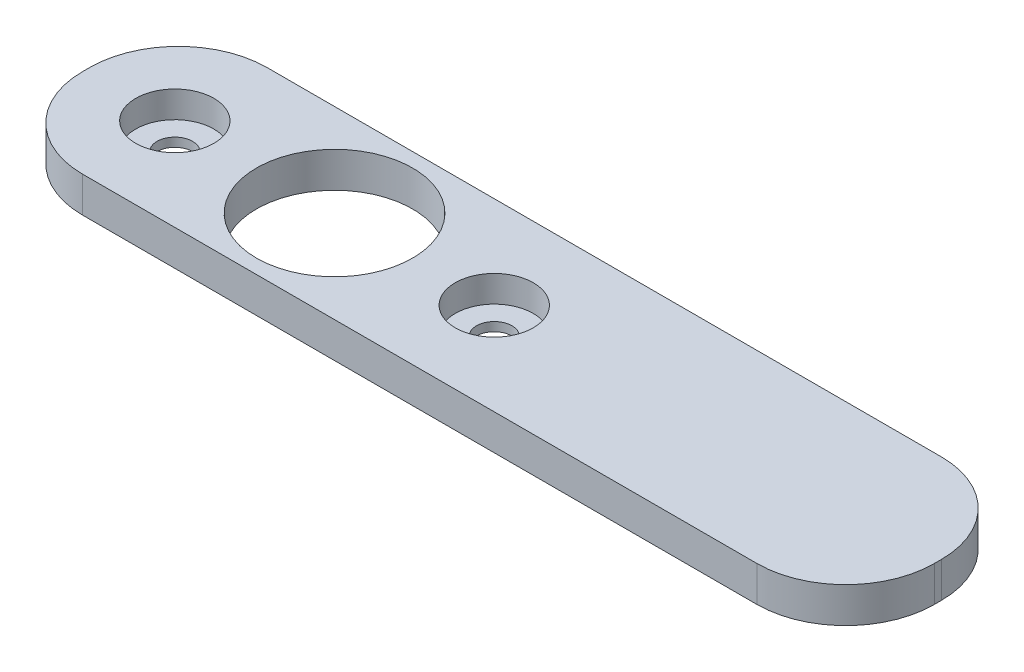
ISO-10303-21;
HEADER;
FILE_DESCRIPTION(('STEP AP214'),'2;1');
FILE_NAME('part.step','',(''),(''),'','','');
FILE_SCHEMA(('AUTOMOTIVE_DESIGN { 1 0 10303 214 1 1 1 1 }'));
ENDSEC;
DATA;
#1=APPLICATION_CONTEXT('core data for automotive mechanical design processes');
#2=APPLICATION_PROTOCOL_DEFINITION('international standard','automotive_design',2000,#1);
#3=PRODUCT_CONTEXT('',#1,'mechanical');
#4=PRODUCT('Part','Part','',(#3));
#5=PRODUCT_RELATED_PRODUCT_CATEGORY('part','',(#4));
#6=PRODUCT_DEFINITION_FORMATION('','',#4);
#7=PRODUCT_DEFINITION_CONTEXT('part definition',#1,'design');
#8=PRODUCT_DEFINITION('design','',#6,#7);
#9=PRODUCT_DEFINITION_SHAPE('','',#8);
#10=(LENGTH_UNIT() NAMED_UNIT(*) SI_UNIT(.MILLI.,.METRE.));
#11=(NAMED_UNIT(*) PLANE_ANGLE_UNIT() SI_UNIT($,.RADIAN.));
#12=(NAMED_UNIT(*) SI_UNIT($,.STERADIAN.) SOLID_ANGLE_UNIT());
#13=UNCERTAINTY_MEASURE_WITH_UNIT(LENGTH_MEASURE(1.E-05),#10,'distance_accuracy_value','');
#14=(GEOMETRIC_REPRESENTATION_CONTEXT(3) GLOBAL_UNCERTAINTY_ASSIGNED_CONTEXT((#13)) GLOBAL_UNIT_ASSIGNED_CONTEXT((#10,
#11,#12)) REPRESENTATION_CONTEXT('',''));
#15=CARTESIAN_POINT('',(0.,0.,0.));
#16=DIRECTION('',(0.,0.,1.));
#17=DIRECTION('',(1.,0.,0.));
#18=AXIS2_PLACEMENT_3D('',#15,#16,#17);
#19=CARTESIAN_POINT('',(45.,10.,0.));
#20=DIRECTION('',(0.,-1.,0.));
#21=DIRECTION('',(0.,0.,-1.));
#22=AXIS2_PLACEMENT_3D('',#19,#20,#21);
#23=PLANE('',#22);
#24=DIRECTION('',(0.,0.,-1.));
#25=VECTOR('',#24,1.);
#26=CARTESIAN_POINT('',(170.,10.,-25.));
#27=LINE('',#26,#25);
#28=CARTESIAN_POINT('',(170.,10.,0.999999999999997));
#29=VERTEX_POINT('',#28);
#30=CARTESIAN_POINT('',(170.,10.,-0.999999999999997));
#31=VERTEX_POINT('',#30);
#32=EDGE_CURVE('E107',#29,#31,#27,.T.);
#33=ORIENTED_EDGE('',*,*,#32,.T.);
#34=CARTESIAN_POINT('',(145.,10.,-0.999999999999997));
#35=DIRECTION('',(0.,-1.,0.));
#36=DIRECTION('',(0.,0.,-1.));
#37=AXIS2_PLACEMENT_3D('',#34,#35,#36);
#38=CIRCLE('',#37,25.);
#39=CARTESIAN_POINT('',(145.,10.,-26.));
#40=VERTEX_POINT('',#39);
#41=EDGE_CURVE('E142',#31,#40,#38,.F.);
#42=ORIENTED_EDGE('',*,*,#41,.T.);
#43=DIRECTION('',(1.,0.,0.));
#44=VECTOR('',#43,1.);
#45=CARTESIAN_POINT('',(0.,10.,-26.));
#46=LINE('',#45,#44);
#47=CARTESIAN_POINT('',(-45.,10.,-26.));
#48=VERTEX_POINT('',#47);
#49=EDGE_CURVE('E166',#48,#40,#46,.T.);
#50=ORIENTED_EDGE('',*,*,#49,.F.);
#51=CARTESIAN_POINT('',(-45.,10.,-0.999999999999997));
#52=DIRECTION('',(0.,-1.,0.));
#53=DIRECTION('',(0.,0.,-1.));
#54=AXIS2_PLACEMENT_3D('',#51,#52,#53);
#55=CIRCLE('',#54,25.);
#56=CARTESIAN_POINT('',(-70.,10.,-0.999999999999997));
#57=VERTEX_POINT('',#56);
#58=EDGE_CURVE('E140',#48,#57,#55,.F.);
#59=ORIENTED_EDGE('',*,*,#58,.T.);
#60=DIRECTION('',(0.,0.,-1.));
#61=VECTOR('',#60,1.);
#62=CARTESIAN_POINT('',(-70.,10.,27.));
#63=LINE('',#62,#61);
#64=CARTESIAN_POINT('',(-70.,10.,0.999999999999997));
#65=VERTEX_POINT('',#64);
#66=EDGE_CURVE('E169',#65,#57,#63,.T.);
#67=ORIENTED_EDGE('',*,*,#66,.F.);
#68=CARTESIAN_POINT('',(-45.,10.,0.999999999999997));
#69=DIRECTION('',(0.,-1.,0.));
#70=DIRECTION('',(0.,0.,-1.));
#71=AXIS2_PLACEMENT_3D('',#68,#69,#70);
#72=CIRCLE('',#71,25.);
#73=CARTESIAN_POINT('',(-45.,10.,26.));
#74=VERTEX_POINT('',#73);
#75=EDGE_CURVE('E114',#65,#74,#72,.F.);
#76=ORIENTED_EDGE('',*,*,#75,.T.);
#77=DIRECTION('',(1.,0.,0.));
#78=VECTOR('',#77,1.);
#79=CARTESIAN_POINT('',(0.,10.,26.));
#80=LINE('',#79,#78);
#81=CARTESIAN_POINT('',(145.,10.,26.));
#82=VERTEX_POINT('',#81);
#83=EDGE_CURVE('E109',#74,#82,#80,.T.);
#84=ORIENTED_EDGE('',*,*,#83,.T.);
#85=CARTESIAN_POINT('',(145.,10.,0.999999999999997));
#86=DIRECTION('',(0.,-1.,0.));
#87=DIRECTION('',(0.,0.,-1.));
#88=AXIS2_PLACEMENT_3D('',#85,#86,#87);
#89=CIRCLE('',#88,25.);
#90=EDGE_CURVE('E104',#82,#29,#89,.F.);
#91=ORIENTED_EDGE('',*,*,#90,.T.);
#92=EDGE_LOOP('',(#33,#42,#50,#59,#67,#76,#84,#91));
#93=FACE_BOUND('',#92,.T.);
#94=CARTESIAN_POINT('',(-45.,10.,0.));
#95=DIRECTION('',(0.,1.,0.));
#96=DIRECTION('',(0.,0.,-1.));
#97=AXIS2_PLACEMENT_3D('',#94,#95,#96);
#98=CIRCLE('',#97,11.);
#99=CARTESIAN_POINT('',(-45.,10.,-11.));
#100=VERTEX_POINT('',#99);
#101=EDGE_CURVE('E129',#100,#100,#98,.T.);
#102=ORIENTED_EDGE('',*,*,#101,.F.);
#103=EDGE_LOOP('',(#102));
#104=FACE_BOUND('',#103,.T.);
#105=CARTESIAN_POINT('',(0.,10.,0.));
#106=DIRECTION('',(0.,1.,0.));
#107=DIRECTION('',(0.,0.,1.));
#108=AXIS2_PLACEMENT_3D('',#105,#106,#107);
#109=CIRCLE('',#108,22.);
#110=CARTESIAN_POINT('',(0.,10.,22.));
#111=VERTEX_POINT('',#110);
#112=EDGE_CURVE('E133',#111,#111,#109,.T.);
#113=ORIENTED_EDGE('',*,*,#112,.F.);
#114=EDGE_LOOP('',(#113));
#115=FACE_BOUND('',#114,.T.);
#116=CARTESIAN_POINT('',(45.,10.,0.));
#117=DIRECTION('',(0.,1.,0.));
#118=DIRECTION('',(0.,0.,1.));
#119=AXIS2_PLACEMENT_3D('',#116,#117,#118);
#120=CIRCLE('',#119,11.);
#121=CARTESIAN_POINT('',(45.,10.,11.));
#122=VERTEX_POINT('',#121);
#123=EDGE_CURVE('E187',#122,#122,#120,.T.);
#124=ORIENTED_EDGE('',*,*,#123,.F.);
#125=EDGE_LOOP('',(#124));
#126=FACE_BOUND('',#125,.T.);
#127=ADVANCED_FACE('F38',(#93,#104,#115,#126),#23,.F.);
#128=CARTESIAN_POINT('',(45.,0.,0.));
#129=DIRECTION('',(0.,-1.,0.));
#130=DIRECTION('',(0.,0.,-1.));
#131=AXIS2_PLACEMENT_3D('',#128,#129,#130);
#132=PLANE('',#131);
#133=DIRECTION('',(1.,0.,0.));
#134=VECTOR('',#133,1.);
#135=CARTESIAN_POINT('',(0.,0.,-26.));
#136=LINE('',#135,#134);
#137=CARTESIAN_POINT('',(-45.,0.,-26.));
#138=VERTEX_POINT('',#137);
#139=CARTESIAN_POINT('',(145.,0.,-26.));
#140=VERTEX_POINT('',#139);
#141=EDGE_CURVE('E163',#138,#140,#136,.T.);
#142=ORIENTED_EDGE('',*,*,#141,.T.);
#143=CARTESIAN_POINT('',(145.,0.,-0.999999999999997));
#144=DIRECTION('',(0.,-1.,0.));
#145=DIRECTION('',(0.,0.,-1.));
#146=AXIS2_PLACEMENT_3D('',#143,#144,#145);
#147=CIRCLE('',#146,25.);
#148=CARTESIAN_POINT('',(170.,0.,-0.999999999999997));
#149=VERTEX_POINT('',#148);
#150=EDGE_CURVE('E153',#140,#149,#147,.T.);
#151=ORIENTED_EDGE('',*,*,#150,.T.);
#152=DIRECTION('',(0.,0.,-1.));
#153=VECTOR('',#152,1.);
#154=CARTESIAN_POINT('',(170.,0.,-25.));
#155=LINE('',#154,#153);
#156=CARTESIAN_POINT('',(170.,0.,0.999999999999997));
#157=VERTEX_POINT('',#156);
#158=EDGE_CURVE('E124',#157,#149,#155,.T.);
#159=ORIENTED_EDGE('',*,*,#158,.F.);
#160=CARTESIAN_POINT('',(145.,0.,0.999999999999997));
#161=DIRECTION('',(0.,-1.,0.));
#162=DIRECTION('',(0.,0.,-1.));
#163=AXIS2_PLACEMENT_3D('',#160,#161,#162);
#164=CIRCLE('',#163,25.);
#165=CARTESIAN_POINT('',(145.,0.,26.));
#166=VERTEX_POINT('',#165);
#167=EDGE_CURVE('E128',#157,#166,#164,.T.);
#168=ORIENTED_EDGE('',*,*,#167,.T.);
#169=DIRECTION('',(1.,0.,0.));
#170=VECTOR('',#169,1.);
#171=CARTESIAN_POINT('',(0.,0.,26.));
#172=LINE('',#171,#170);
#173=CARTESIAN_POINT('',(-45.,0.,26.));
#174=VERTEX_POINT('',#173);
#175=EDGE_CURVE('E125',#174,#166,#172,.T.);
#176=ORIENTED_EDGE('',*,*,#175,.F.);
#177=CARTESIAN_POINT('',(-45.,0.,0.999999999999997));
#178=DIRECTION('',(0.,-1.,0.));
#179=DIRECTION('',(0.,0.,-1.));
#180=AXIS2_PLACEMENT_3D('',#177,#178,#179);
#181=CIRCLE('',#180,25.);
#182=CARTESIAN_POINT('',(-70.,0.,0.999999999999997));
#183=VERTEX_POINT('',#182);
#184=EDGE_CURVE('E60',#174,#183,#181,.T.);
#185=ORIENTED_EDGE('',*,*,#184,.T.);
#186=DIRECTION('',(0.,0.,-1.));
#187=VECTOR('',#186,1.);
#188=CARTESIAN_POINT('',(-70.,0.,27.));
#189=LINE('',#188,#187);
#190=CARTESIAN_POINT('',(-70.,0.,-0.999999999999997));
#191=VERTEX_POINT('',#190);
#192=EDGE_CURVE('E171',#183,#191,#189,.T.);
#193=ORIENTED_EDGE('',*,*,#192,.T.);
#194=CARTESIAN_POINT('',(-45.,0.,-0.999999999999997));
#195=DIRECTION('',(0.,-1.,0.));
#196=DIRECTION('',(0.,0.,-1.));
#197=AXIS2_PLACEMENT_3D('',#194,#195,#196);
#198=CIRCLE('',#197,25.);
#199=EDGE_CURVE('E151',#191,#138,#198,.T.);
#200=ORIENTED_EDGE('',*,*,#199,.T.);
#201=EDGE_LOOP('',(#142,#151,#159,#168,#176,#185,#193,#200));
#202=FACE_BOUND('',#201,.T.);
#203=CARTESIAN_POINT('',(0.,0.,0.));
#204=DIRECTION('',(0.,1.,0.));
#205=DIRECTION('',(0.,0.,1.));
#206=AXIS2_PLACEMENT_3D('',#203,#204,#205);
#207=CIRCLE('',#206,22.);
#208=CARTESIAN_POINT('',(0.,0.,22.));
#209=VERTEX_POINT('',#208);
#210=EDGE_CURVE('E190',#209,#209,#207,.T.);
#211=ORIENTED_EDGE('',*,*,#210,.T.);
#212=EDGE_LOOP('',(#211));
#213=FACE_BOUND('',#212,.T.);
#214=CARTESIAN_POINT('',(-45.,0.,0.));
#215=DIRECTION('',(0.,-1.,0.));
#216=DIRECTION('',(0.,0.,-1.));
#217=AXIS2_PLACEMENT_3D('',#214,#215,#216);
#218=CIRCLE('',#217,5.);
#219=CARTESIAN_POINT('',(-45.,0.,-5.00000000000001));
#220=VERTEX_POINT('',#219);
#221=EDGE_CURVE('E184',#220,#220,#218,.T.);
#222=ORIENTED_EDGE('',*,*,#221,.F.);
#223=EDGE_LOOP('',(#222));
#224=FACE_BOUND('',#223,.T.);
#225=CARTESIAN_POINT('',(45.,0.,0.));
#226=DIRECTION('',(0.,-1.,0.));
#227=DIRECTION('',(0.,0.,-1.));
#228=AXIS2_PLACEMENT_3D('',#225,#226,#227);
#229=CIRCLE('',#228,5.);
#230=CARTESIAN_POINT('',(45.,0.,-5.00000000000001));
#231=VERTEX_POINT('',#230);
#232=EDGE_CURVE('E173',#231,#231,#229,.T.);
#233=ORIENTED_EDGE('',*,*,#232,.F.);
#234=EDGE_LOOP('',(#233));
#235=FACE_BOUND('',#234,.T.);
#236=ADVANCED_FACE('F213',(#202,#213,#224,#235),#132,.T.);
#237=CARTESIAN_POINT('',(45.,10.,0.));
#238=DIRECTION('',(0.,-1.,0.));
#239=DIRECTION('',(0.,0.,-1.));
#240=AXIS2_PLACEMENT_3D('',#237,#238,#239);
#241=CYLINDRICAL_SURFACE('',#240,11.);
#242=ORIENTED_EDGE('',*,*,#123,.T.);
#243=EDGE_LOOP('',(#242));
#244=FACE_BOUND('',#243,.T.);
#245=CARTESIAN_POINT('',(45.,2.5,0.));
#246=DIRECTION('',(0.,-1.,0.));
#247=DIRECTION('',(0.,0.,-1.));
#248=AXIS2_PLACEMENT_3D('',#245,#246,#247);
#249=CIRCLE('',#248,11.);
#250=CARTESIAN_POINT('',(45.,2.5,-11.));
#251=VERTEX_POINT('',#250);
#252=EDGE_CURVE('E136',#251,#251,#249,.T.);
#253=ORIENTED_EDGE('',*,*,#252,.T.);
#254=EDGE_LOOP('',(#253));
#255=FACE_BOUND('',#254,.T.);
#256=ADVANCED_FACE('F216',(#244,#255),#241,.F.);
#257=CARTESIAN_POINT('',(-45.,10.,0.));
#258=DIRECTION('',(0.,-1.,0.));
#259=DIRECTION('',(0.,0.,-1.));
#260=AXIS2_PLACEMENT_3D('',#257,#258,#259);
#261=CYLINDRICAL_SURFACE('',#260,11.);
#262=ORIENTED_EDGE('',*,*,#101,.T.);
#263=EDGE_LOOP('',(#262));
#264=FACE_BOUND('',#263,.T.);
#265=CARTESIAN_POINT('',(-45.,2.5,0.));
#266=DIRECTION('',(0.,-1.,0.));
#267=DIRECTION('',(0.,0.,-1.));
#268=AXIS2_PLACEMENT_3D('',#265,#266,#267);
#269=CIRCLE('',#268,11.);
#270=CARTESIAN_POINT('',(-45.,2.5,-11.));
#271=VERTEX_POINT('',#270);
#272=EDGE_CURVE('E183',#271,#271,#269,.T.);
#273=ORIENTED_EDGE('',*,*,#272,.T.);
#274=EDGE_LOOP('',(#273));
#275=FACE_BOUND('',#274,.T.);
#276=ADVANCED_FACE('F197',(#264,#275),#261,.F.);
#277=CARTESIAN_POINT('',(0.,10.,0.));
#278=DIRECTION('',(0.,-1.,0.));
#279=DIRECTION('',(0.,0.,-1.));
#280=AXIS2_PLACEMENT_3D('',#277,#278,#279);
#281=CYLINDRICAL_SURFACE('',#280,22.);
#282=ORIENTED_EDGE('',*,*,#112,.T.);
#283=EDGE_LOOP('',(#282));
#284=FACE_BOUND('',#283,.T.);
#285=ORIENTED_EDGE('',*,*,#210,.F.);
#286=EDGE_LOOP('',(#285));
#287=FACE_BOUND('',#286,.T.);
#288=ADVANCED_FACE('F203',(#284,#287),#281,.F.);
#289=CARTESIAN_POINT('',(-45.,2.5,0.));
#290=DIRECTION('',(0.,-1.,0.));
#291=DIRECTION('',(0.,0.,-1.));
#292=AXIS2_PLACEMENT_3D('',#289,#290,#291);
#293=PLANE('',#292);
#294=ORIENTED_EDGE('',*,*,#272,.F.);
#295=EDGE_LOOP('',(#294));
#296=FACE_BOUND('',#295,.T.);
#297=CARTESIAN_POINT('',(-45.,2.5,0.));
#298=DIRECTION('',(0.,-1.,0.));
#299=DIRECTION('',(0.,0.,-1.));
#300=AXIS2_PLACEMENT_3D('',#297,#298,#299);
#301=CIRCLE('',#300,5.);
#302=CARTESIAN_POINT('',(-45.,2.5,-5.00000000000001));
#303=VERTEX_POINT('',#302);
#304=EDGE_CURVE('E180',#303,#303,#301,.T.);
#305=ORIENTED_EDGE('',*,*,#304,.T.);
#306=EDGE_LOOP('',(#305));
#307=FACE_BOUND('',#306,.T.);
#308=ADVANCED_FACE('F199',(#296,#307),#293,.F.);
#309=CARTESIAN_POINT('',(-45.,2.5,0.));
#310=DIRECTION('',(0.,-1.,0.));
#311=DIRECTION('',(0.,0.,-1.));
#312=AXIS2_PLACEMENT_3D('',#309,#310,#311);
#313=CYLINDRICAL_SURFACE('',#312,5.);
#314=ORIENTED_EDGE('',*,*,#304,.F.);
#315=EDGE_LOOP('',(#314));
#316=FACE_BOUND('',#315,.T.);
#317=ORIENTED_EDGE('',*,*,#221,.T.);
#318=EDGE_LOOP('',(#317));
#319=FACE_BOUND('',#318,.T.);
#320=ADVANCED_FACE('F202',(#316,#319),#313,.F.);
#321=CARTESIAN_POINT('',(45.,2.5,0.));
#322=DIRECTION('',(0.,-1.,0.));
#323=DIRECTION('',(0.,0.,-1.));
#324=AXIS2_PLACEMENT_3D('',#321,#322,#323);
#325=PLANE('',#324);
#326=ORIENTED_EDGE('',*,*,#252,.F.);
#327=EDGE_LOOP('',(#326));
#328=FACE_BOUND('',#327,.T.);
#329=CARTESIAN_POINT('',(45.,2.5,0.));
#330=DIRECTION('',(0.,-1.,0.));
#331=DIRECTION('',(0.,0.,-1.));
#332=AXIS2_PLACEMENT_3D('',#329,#330,#331);
#333=CIRCLE('',#332,5.);
#334=CARTESIAN_POINT('',(45.,2.5,-5.00000000000001));
#335=VERTEX_POINT('',#334);
#336=EDGE_CURVE('E175',#335,#335,#333,.T.);
#337=ORIENTED_EDGE('',*,*,#336,.T.);
#338=EDGE_LOOP('',(#337));
#339=FACE_BOUND('',#338,.T.);
#340=ADVANCED_FACE('F209',(#328,#339),#325,.F.);
#341=CARTESIAN_POINT('',(45.,2.5,0.));
#342=DIRECTION('',(0.,-1.,0.));
#343=DIRECTION('',(0.,0.,-1.));
#344=AXIS2_PLACEMENT_3D('',#341,#342,#343);
#345=CYLINDRICAL_SURFACE('',#344,5.);
#346=ORIENTED_EDGE('',*,*,#336,.F.);
#347=EDGE_LOOP('',(#346));
#348=FACE_BOUND('',#347,.T.);
#349=ORIENTED_EDGE('',*,*,#232,.T.);
#350=EDGE_LOOP('',(#349));
#351=FACE_BOUND('',#350,.T.);
#352=ADVANCED_FACE('F220',(#348,#351),#345,.F.);
#353=CARTESIAN_POINT('',(-70.,0.,27.));
#354=DIRECTION('',(1.,0.,0.));
#355=DIRECTION('',(0.,0.,-1.));
#356=AXIS2_PLACEMENT_3D('',#353,#354,#355);
#357=PLANE('',#356);
#358=ORIENTED_EDGE('',*,*,#66,.T.);
#359=DIRECTION('',(0.,1.,0.));
#360=VECTOR('',#359,1.);
#361=CARTESIAN_POINT('',(-70.,0.,-0.999999999999997));
#362=LINE('',#361,#360);
#363=EDGE_CURVE('E53',#57,#191,#362,.F.);
#364=ORIENTED_EDGE('',*,*,#363,.T.);
#365=ORIENTED_EDGE('',*,*,#192,.F.);
#366=DIRECTION('',(0.,1.,0.));
#367=VECTOR('',#366,1.);
#368=CARTESIAN_POINT('',(-70.,10.,0.999999999999997));
#369=LINE('',#368,#367);
#370=EDGE_CURVE('E155',#183,#65,#369,.T.);
#371=ORIENTED_EDGE('',*,*,#370,.T.);
#372=EDGE_LOOP('',(#358,#364,#365,#371));
#373=FACE_BOUND('',#372,.T.);
#374=ADVANCED_FACE('F222',(#373),#357,.F.);
#375=CARTESIAN_POINT('',(170.,0.,-25.));
#376=DIRECTION('',(1.,0.,0.));
#377=DIRECTION('',(0.,0.,-1.));
#378=AXIS2_PLACEMENT_3D('',#375,#376,#377);
#379=PLANE('',#378);
#380=ORIENTED_EDGE('',*,*,#158,.T.);
#381=DIRECTION('',(0.,1.,0.));
#382=VECTOR('',#381,1.);
#383=CARTESIAN_POINT('',(170.,10.,-0.999999999999997));
#384=LINE('',#383,#382);
#385=EDGE_CURVE('E115',#149,#31,#384,.T.);
#386=ORIENTED_EDGE('',*,*,#385,.T.);
#387=ORIENTED_EDGE('',*,*,#32,.F.);
#388=DIRECTION('',(0.,1.,0.));
#389=VECTOR('',#388,1.);
#390=CARTESIAN_POINT('',(170.,0.,0.999999999999997));
#391=LINE('',#390,#389);
#392=EDGE_CURVE('E121',#29,#157,#391,.F.);
#393=ORIENTED_EDGE('',*,*,#392,.T.);
#394=EDGE_LOOP('',(#380,#386,#387,#393));
#395=FACE_BOUND('',#394,.T.);
#396=ADVANCED_FACE('F120',(#395),#379,.T.);
#397=CARTESIAN_POINT('',(0.,0.,26.));
#398=DIRECTION('',(0.,0.,1.));
#399=DIRECTION('',(1.,0.,0.));
#400=AXIS2_PLACEMENT_3D('',#397,#398,#399);
#401=PLANE('',#400);
#402=ORIENTED_EDGE('',*,*,#83,.F.);
#403=DIRECTION('',(0.,1.,0.));
#404=VECTOR('',#403,1.);
#405=CARTESIAN_POINT('',(-45.,0.,26.));
#406=LINE('',#405,#404);
#407=EDGE_CURVE('E11',#74,#174,#406,.F.);
#408=ORIENTED_EDGE('',*,*,#407,.T.);
#409=ORIENTED_EDGE('',*,*,#175,.T.);
#410=DIRECTION('',(0.,1.,0.));
#411=VECTOR('',#410,1.);
#412=CARTESIAN_POINT('',(145.,0.,26.));
#413=LINE('',#412,#411);
#414=EDGE_CURVE('E46',#166,#82,#413,.T.);
#415=ORIENTED_EDGE('',*,*,#414,.T.);
#416=EDGE_LOOP('',(#402,#408,#409,#415));
#417=FACE_BOUND('',#416,.T.);
#418=ADVANCED_FACE('F160',(#417),#401,.T.);
#419=CARTESIAN_POINT('',(0.,0.,-26.));
#420=DIRECTION('',(0.,0.,1.));
#421=DIRECTION('',(1.,0.,0.));
#422=AXIS2_PLACEMENT_3D('',#419,#420,#421);
#423=PLANE('',#422);
#424=ORIENTED_EDGE('',*,*,#49,.T.);
#425=DIRECTION('',(0.,1.,0.));
#426=VECTOR('',#425,1.);
#427=CARTESIAN_POINT('',(145.,0.,-26.));
#428=LINE('',#427,#426);
#429=EDGE_CURVE('E147',#40,#140,#428,.F.);
#430=ORIENTED_EDGE('',*,*,#429,.T.);
#431=ORIENTED_EDGE('',*,*,#141,.F.);
#432=DIRECTION('',(0.,1.,0.));
#433=VECTOR('',#432,1.);
#434=CARTESIAN_POINT('',(-45.,0.,-26.));
#435=LINE('',#434,#433);
#436=EDGE_CURVE('E144',#138,#48,#435,.T.);
#437=ORIENTED_EDGE('',*,*,#436,.T.);
#438=EDGE_LOOP('',(#424,#430,#431,#437));
#439=FACE_BOUND('',#438,.T.);
#440=ADVANCED_FACE('F244',(#439),#423,.F.);
#441=CARTESIAN_POINT('',(145.,0.,-0.999999999999997));
#442=DIRECTION('',(0.,-1.,0.));
#443=DIRECTION('',(0.,0.,-1.));
#444=AXIS2_PLACEMENT_3D('',#441,#442,#443);
#445=CYLINDRICAL_SURFACE('',#444,25.);
#446=ORIENTED_EDGE('',*,*,#150,.F.);
#447=ORIENTED_EDGE('',*,*,#429,.F.);
#448=ORIENTED_EDGE('',*,*,#41,.F.);
#449=ORIENTED_EDGE('',*,*,#385,.F.);
#450=EDGE_LOOP('',(#446,#447,#448,#449));
#451=FACE_BOUND('',#450,.T.);
#452=ADVANCED_FACE('F240',(#451),#445,.T.);
#453=CARTESIAN_POINT('',(-45.,0.,-0.999999999999997));
#454=DIRECTION('',(0.,1.,0.));
#455=DIRECTION('',(0.,0.,1.));
#456=AXIS2_PLACEMENT_3D('',#453,#454,#455);
#457=CYLINDRICAL_SURFACE('',#456,25.);
#458=ORIENTED_EDGE('',*,*,#199,.F.);
#459=ORIENTED_EDGE('',*,*,#363,.F.);
#460=ORIENTED_EDGE('',*,*,#58,.F.);
#461=ORIENTED_EDGE('',*,*,#436,.F.);
#462=EDGE_LOOP('',(#458,#459,#460,#461));
#463=FACE_BOUND('',#462,.T.);
#464=ADVANCED_FACE('F243',(#463),#457,.T.);
#465=CARTESIAN_POINT('',(-45.,0.,0.999999999999997));
#466=DIRECTION('',(0.,-1.,0.));
#467=DIRECTION('',(0.,0.,-1.));
#468=AXIS2_PLACEMENT_3D('',#465,#466,#467);
#469=CYLINDRICAL_SURFACE('',#468,25.);
#470=ORIENTED_EDGE('',*,*,#184,.F.);
#471=ORIENTED_EDGE('',*,*,#407,.F.);
#472=ORIENTED_EDGE('',*,*,#75,.F.);
#473=ORIENTED_EDGE('',*,*,#370,.F.);
#474=EDGE_LOOP('',(#470,#471,#472,#473));
#475=FACE_BOUND('',#474,.T.);
#476=ADVANCED_FACE('F247',(#475),#469,.T.);
#477=CARTESIAN_POINT('',(145.,0.,0.999999999999997));
#478=DIRECTION('',(0.,1.,0.));
#479=DIRECTION('',(0.,0.,1.));
#480=AXIS2_PLACEMENT_3D('',#477,#478,#479);
#481=CYLINDRICAL_SURFACE('',#480,25.);
#482=ORIENTED_EDGE('',*,*,#167,.F.);
#483=ORIENTED_EDGE('',*,*,#392,.F.);
#484=ORIENTED_EDGE('',*,*,#90,.F.);
#485=ORIENTED_EDGE('',*,*,#414,.F.);
#486=EDGE_LOOP('',(#482,#483,#484,#485));
#487=FACE_BOUND('',#486,.T.);
#488=ADVANCED_FACE('F40',(#487),#481,.T.);
#489=CLOSED_SHELL('',(#127,#236,#256,#276,#288,#308,#320,#340,#352,#374,#396,#418,#440,#452,
#464,#476,#488));
#490=MANIFOLD_SOLID_BREP('B2',#489);
#491=ADVANCED_BREP_SHAPE_REPRESENTATION('',(#18,#490),#14);
#492=SHAPE_DEFINITION_REPRESENTATION(#9,#491);
ENDSEC;
END-ISO-10303-21;
